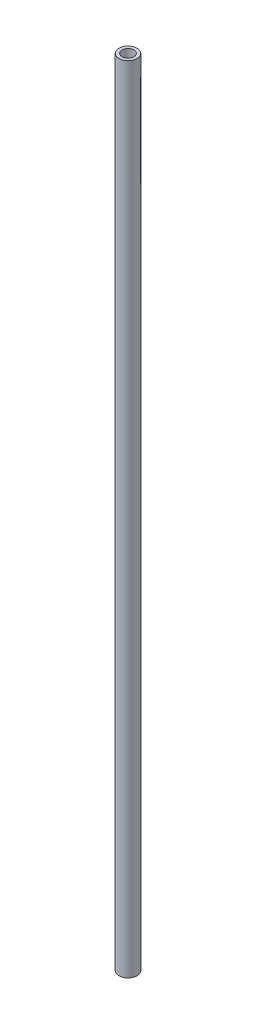
ISO-10303-21;
HEADER;
FILE_DESCRIPTION(('STEP AP214'),'2;1');
FILE_NAME('part.step','',(''),(''),'','','');
FILE_SCHEMA(('AUTOMOTIVE_DESIGN { 1 0 10303 214 1 1 1 1 }'));
ENDSEC;
DATA;
#1=APPLICATION_CONTEXT('core data for automotive mechanical design processes');
#2=APPLICATION_PROTOCOL_DEFINITION('international standard','automotive_design',2000,#1);
#3=PRODUCT_CONTEXT('',#1,'mechanical');
#4=PRODUCT('Part','Part','',(#3));
#5=PRODUCT_RELATED_PRODUCT_CATEGORY('part','',(#4));
#6=PRODUCT_DEFINITION_FORMATION('','',#4);
#7=PRODUCT_DEFINITION_CONTEXT('part definition',#1,'design');
#8=PRODUCT_DEFINITION('design','',#6,#7);
#9=PRODUCT_DEFINITION_SHAPE('','',#8);
#10=(LENGTH_UNIT() NAMED_UNIT(*) SI_UNIT(.MILLI.,.METRE.));
#11=(NAMED_UNIT(*) PLANE_ANGLE_UNIT() SI_UNIT($,.RADIAN.));
#12=(NAMED_UNIT(*) SI_UNIT($,.STERADIAN.) SOLID_ANGLE_UNIT());
#13=UNCERTAINTY_MEASURE_WITH_UNIT(LENGTH_MEASURE(1.E-05),#10,'distance_accuracy_value','');
#14=(GEOMETRIC_REPRESENTATION_CONTEXT(3) GLOBAL_UNCERTAINTY_ASSIGNED_CONTEXT((#13)) GLOBAL_UNIT_ASSIGNED_CONTEXT((#10,
#11,#12)) REPRESENTATION_CONTEXT('',''));
#15=CARTESIAN_POINT('',(0.,0.,0.));
#16=DIRECTION('',(0.,0.,1.));
#17=DIRECTION('',(1.,0.,0.));
#18=AXIS2_PLACEMENT_3D('',#15,#16,#17);
#19=CARTESIAN_POINT('',(0.,255.3116,0.));
#20=DIRECTION('',(0.,1.,0.));
#21=DIRECTION('',(0.,0.,1.));
#22=AXIS2_PLACEMENT_3D('',#19,#20,#21);
#23=PLANE('',#22);
#24=CARTESIAN_POINT('',(0.,255.3116,0.));
#25=DIRECTION('',(0.,1.,0.));
#26=DIRECTION('',(0.,0.,1.));
#27=AXIS2_PLACEMENT_3D('',#24,#25,#26);
#28=CIRCLE('',#27,2.9);
#29=CARTESIAN_POINT('',(0.,255.3116,2.9));
#30=VERTEX_POINT('',#29);
#31=EDGE_CURVE('E10',#30,#30,#28,.T.);
#32=ORIENTED_EDGE('',*,*,#31,.T.);
#33=EDGE_LOOP('',(#32));
#34=FACE_BOUND('',#33,.T.);
#35=CARTESIAN_POINT('',(0.,255.3116,0.));
#36=DIRECTION('',(0.,1.,0.));
#37=DIRECTION('',(0.,0.,1.));
#38=AXIS2_PLACEMENT_3D('',#35,#36,#37);
#39=CIRCLE('',#38,1.9);
#40=CARTESIAN_POINT('',(0.,255.3116,1.9));
#41=VERTEX_POINT('',#40);
#42=EDGE_CURVE('E44',#41,#41,#39,.T.);
#43=ORIENTED_EDGE('',*,*,#42,.F.);
#44=EDGE_LOOP('',(#43));
#45=FACE_BOUND('',#44,.T.);
#46=ADVANCED_FACE('F33',(#34,#45),#23,.T.);
#47=CARTESIAN_POINT('',(0.,0.,0.));
#48=DIRECTION('',(0.,1.,0.));
#49=DIRECTION('',(0.,0.,1.));
#50=AXIS2_PLACEMENT_3D('',#47,#48,#49);
#51=PLANE('',#50);
#52=CARTESIAN_POINT('',(0.,0.,0.));
#53=DIRECTION('',(0.,1.,0.));
#54=DIRECTION('',(0.,0.,1.));
#55=AXIS2_PLACEMENT_3D('',#52,#53,#54);
#56=CIRCLE('',#55,2.9);
#57=CARTESIAN_POINT('',(0.,0.,2.9));
#58=VERTEX_POINT('',#57);
#59=EDGE_CURVE('E37',#58,#58,#56,.T.);
#60=ORIENTED_EDGE('',*,*,#59,.F.);
#61=EDGE_LOOP('',(#60));
#62=FACE_BOUND('',#61,.T.);
#63=CARTESIAN_POINT('',(0.,0.,0.));
#64=DIRECTION('',(0.,1.,0.));
#65=DIRECTION('',(0.,0.,1.));
#66=AXIS2_PLACEMENT_3D('',#63,#64,#65);
#67=CIRCLE('',#66,1.9);
#68=CARTESIAN_POINT('',(0.,0.,1.9));
#69=VERTEX_POINT('',#68);
#70=EDGE_CURVE('E46',#69,#69,#67,.T.);
#71=ORIENTED_EDGE('',*,*,#70,.T.);
#72=EDGE_LOOP('',(#71));
#73=FACE_BOUND('',#72,.T.);
#74=ADVANCED_FACE('F56',(#62,#73),#51,.F.);
#75=CARTESIAN_POINT('',(0.,255.3116,0.));
#76=DIRECTION('',(0.,-1.,0.));
#77=DIRECTION('',(0.,0.,-1.));
#78=AXIS2_PLACEMENT_3D('',#75,#76,#77);
#79=CYLINDRICAL_SURFACE('',#78,2.9);
#80=ORIENTED_EDGE('',*,*,#31,.F.);
#81=EDGE_LOOP('',(#80));
#82=FACE_BOUND('',#81,.T.);
#83=ORIENTED_EDGE('',*,*,#59,.T.);
#84=EDGE_LOOP('',(#83));
#85=FACE_BOUND('',#84,.T.);
#86=ADVANCED_FACE('F35',(#82,#85),#79,.T.);
#87=CARTESIAN_POINT('',(0.,255.3116,0.));
#88=DIRECTION('',(0.,-1.,0.));
#89=DIRECTION('',(0.,0.,-1.));
#90=AXIS2_PLACEMENT_3D('',#87,#88,#89);
#91=CYLINDRICAL_SURFACE('',#90,1.9);
#92=ORIENTED_EDGE('',*,*,#42,.T.);
#93=EDGE_LOOP('',(#92));
#94=FACE_BOUND('',#93,.T.);
#95=ORIENTED_EDGE('',*,*,#70,.F.);
#96=EDGE_LOOP('',(#95));
#97=FACE_BOUND('',#96,.T.);
#98=ADVANCED_FACE('F52',(#94,#97),#91,.F.);
#99=CLOSED_SHELL('',(#46,#74,#86,#98));
#100=MANIFOLD_SOLID_BREP('B2',#99);
#101=ADVANCED_BREP_SHAPE_REPRESENTATION('',(#18,#100),#14);
#102=SHAPE_DEFINITION_REPRESENTATION(#9,#101);
ENDSEC;
END-ISO-10303-21;
